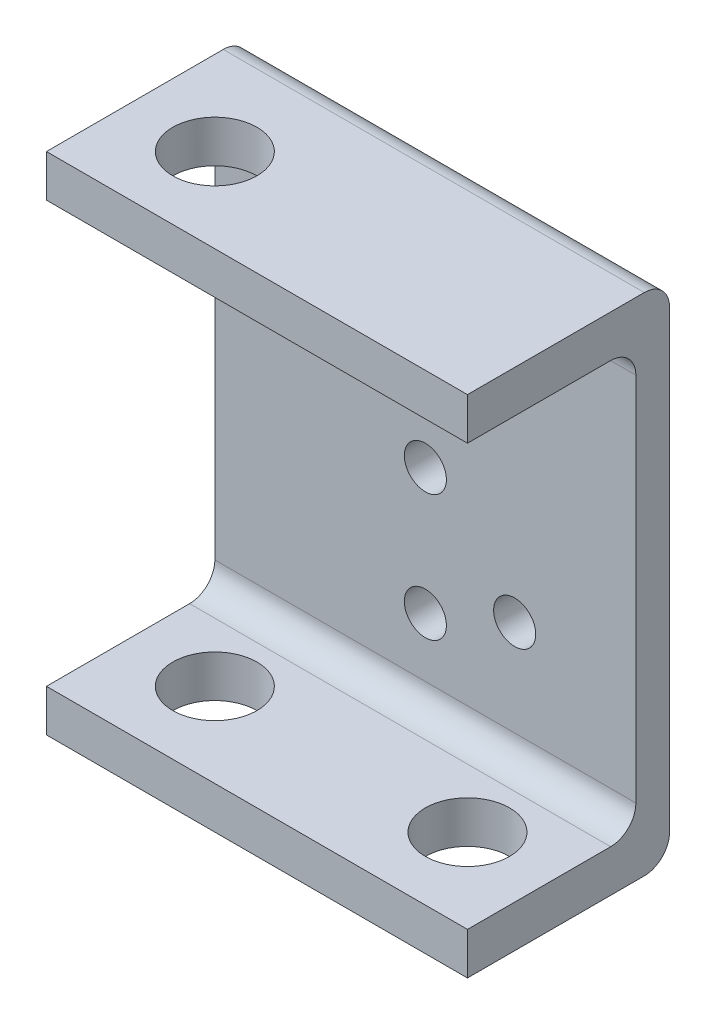
ISO-10303-21;
HEADER;
FILE_DESCRIPTION(('STEP AP214'),'2;1');
FILE_NAME('part.step','',(''),(''),'','','');
FILE_SCHEMA(('AUTOMOTIVE_DESIGN { 1 0 10303 214 1 1 1 1 }'));
ENDSEC;
DATA;
#1=APPLICATION_CONTEXT('core data for automotive mechanical design processes');
#2=APPLICATION_PROTOCOL_DEFINITION('international standard','automotive_design',2000,#1);
#3=PRODUCT_CONTEXT('',#1,'mechanical');
#4=PRODUCT('Part','Part','',(#3));
#5=PRODUCT_RELATED_PRODUCT_CATEGORY('part','',(#4));
#6=PRODUCT_DEFINITION_FORMATION('','',#4);
#7=PRODUCT_DEFINITION_CONTEXT('part definition',#1,'design');
#8=PRODUCT_DEFINITION('design','',#6,#7);
#9=PRODUCT_DEFINITION_SHAPE('','',#8);
#10=(LENGTH_UNIT() NAMED_UNIT(*) SI_UNIT(.MILLI.,.METRE.));
#11=(NAMED_UNIT(*) PLANE_ANGLE_UNIT() SI_UNIT($,.RADIAN.));
#12=(NAMED_UNIT(*) SI_UNIT($,.STERADIAN.) SOLID_ANGLE_UNIT());
#13=UNCERTAINTY_MEASURE_WITH_UNIT(LENGTH_MEASURE(1.E-05),#10,'distance_accuracy_value','');
#14=(GEOMETRIC_REPRESENTATION_CONTEXT(3) GLOBAL_UNCERTAINTY_ASSIGNED_CONTEXT((#13)) GLOBAL_UNIT_ASSIGNED_CONTEXT((#10,
#11,#12)) REPRESENTATION_CONTEXT('',''));
#15=CARTESIAN_POINT('',(0.,0.,0.));
#16=DIRECTION('',(0.,0.,1.));
#17=DIRECTION('',(1.,0.,0.));
#18=AXIS2_PLACEMENT_3D('',#15,#16,#17);
#19=CARTESIAN_POINT('',(25.,-22.,7.));
#20=DIRECTION('',(-1.,0.,0.));
#21=DIRECTION('',(0.,0.,1.));
#22=AXIS2_PLACEMENT_3D('',#19,#20,#21);
#23=CYLINDRICAL_SURFACE('',#22,3.);
#24=CARTESIAN_POINT('',(-25.,-22.,7.));
#25=DIRECTION('',(-1.,0.,0.));
#26=DIRECTION('',(0.,0.,1.));
#27=AXIS2_PLACEMENT_3D('',#24,#25,#26);
#28=CIRCLE('',#27,3.);
#29=CARTESIAN_POINT('',(-25.,-22.,4.));
#30=VERTEX_POINT('',#29);
#31=CARTESIAN_POINT('',(-25.,-25.,7.));
#32=VERTEX_POINT('',#31);
#33=EDGE_CURVE('E156',#30,#32,#28,.T.);
#34=ORIENTED_EDGE('',*,*,#33,.T.);
#35=DIRECTION('',(-1.,0.,0.));
#36=VECTOR('',#35,1.);
#37=CARTESIAN_POINT('',(25.,-25.,7.));
#38=LINE('',#37,#36);
#39=CARTESIAN_POINT('',(25.,-25.,7.));
#40=VERTEX_POINT('',#39);
#41=EDGE_CURVE('E11',#40,#32,#38,.T.);
#42=ORIENTED_EDGE('',*,*,#41,.F.);
#43=CARTESIAN_POINT('',(25.,-22.,7.));
#44=DIRECTION('',(-1.,0.,0.));
#45=DIRECTION('',(0.,0.,1.));
#46=AXIS2_PLACEMENT_3D('',#43,#44,#45);
#47=CIRCLE('',#46,3.);
#48=CARTESIAN_POINT('',(25.,-22.,4.));
#49=VERTEX_POINT('',#48);
#50=EDGE_CURVE('E179',#49,#40,#47,.T.);
#51=ORIENTED_EDGE('',*,*,#50,.F.);
#52=DIRECTION('',(-1.,0.,0.));
#53=VECTOR('',#52,1.);
#54=CARTESIAN_POINT('',(25.,-22.,4.));
#55=LINE('',#54,#53);
#56=EDGE_CURVE('E152',#49,#30,#55,.T.);
#57=ORIENTED_EDGE('',*,*,#56,.T.);
#58=EDGE_LOOP('',(#34,#42,#51,#57));
#59=FACE_BOUND('',#58,.T.);
#60=ADVANCED_FACE('F35',(#59),#23,.F.);
#61=CARTESIAN_POINT('',(25.,-25.,7.));
#62=DIRECTION('',(0.,-1.,0.));
#63=DIRECTION('',(0.,0.,-1.));
#64=AXIS2_PLACEMENT_3D('',#61,#62,#63);
#65=PLANE('',#64);
#66=CARTESIAN_POINT('',(15.,-25.,14.));
#67=DIRECTION('',(0.,-1.,0.));
#68=DIRECTION('',(0.,0.,-1.));
#69=AXIS2_PLACEMENT_3D('',#66,#67,#68);
#70=CIRCLE('',#69,5.);
#71=CARTESIAN_POINT('',(15.,-25.,9.00000000000001));
#72=VERTEX_POINT('',#71);
#73=EDGE_CURVE('E309',#72,#72,#70,.F.);
#74=ORIENTED_EDGE('',*,*,#73,.F.);
#75=EDGE_LOOP('',(#74));
#76=FACE_BOUND('',#75,.T.);
#77=CARTESIAN_POINT('',(-15.,-25.,14.));
#78=DIRECTION('',(0.,-1.,0.));
#79=DIRECTION('',(0.,0.,-1.));
#80=AXIS2_PLACEMENT_3D('',#77,#78,#79);
#81=CIRCLE('',#80,5.);
#82=CARTESIAN_POINT('',(-15.,-25.,9.00000000000001));
#83=VERTEX_POINT('',#82);
#84=EDGE_CURVE('E298',#83,#83,#81,.T.);
#85=ORIENTED_EDGE('',*,*,#84,.T.);
#86=EDGE_LOOP('',(#85));
#87=FACE_BOUND('',#86,.T.);
#88=DIRECTION('',(0.,0.,1.));
#89=VECTOR('',#88,1.);
#90=CARTESIAN_POINT('',(-25.,-25.,7.));
#91=LINE('',#90,#89);
#92=CARTESIAN_POINT('',(-25.,-25.,24.));
#93=VERTEX_POINT('',#92);
#94=EDGE_CURVE('E159',#32,#93,#91,.T.);
#95=ORIENTED_EDGE('',*,*,#94,.T.);
#96=DIRECTION('',(-1.,0.,0.));
#97=VECTOR('',#96,1.);
#98=CARTESIAN_POINT('',(25.,-25.,24.));
#99=LINE('',#98,#97);
#100=CARTESIAN_POINT('',(25.,-25.,24.));
#101=VERTEX_POINT('',#100);
#102=EDGE_CURVE('E44',#101,#93,#99,.T.);
#103=ORIENTED_EDGE('',*,*,#102,.F.);
#104=DIRECTION('',(0.,0.,1.));
#105=VECTOR('',#104,1.);
#106=CARTESIAN_POINT('',(25.,-25.,7.));
#107=LINE('',#106,#105);
#108=EDGE_CURVE('E107',#40,#101,#107,.T.);
#109=ORIENTED_EDGE('',*,*,#108,.F.);
#110=ORIENTED_EDGE('',*,*,#41,.T.);
#111=EDGE_LOOP('',(#95,#103,#109,#110));
#112=FACE_BOUND('',#111,.T.);
#113=ADVANCED_FACE('F261',(#76,#87,#112),#65,.F.);
#114=CARTESIAN_POINT('',(25.,-25.,24.));
#115=DIRECTION('',(0.,0.,-1.));
#116=DIRECTION('',(0.,1.,0.));
#117=AXIS2_PLACEMENT_3D('',#114,#115,#116);
#118=PLANE('',#117);
#119=DIRECTION('',(0.,-1.,0.));
#120=VECTOR('',#119,1.);
#121=CARTESIAN_POINT('',(-25.,-25.,24.));
#122=LINE('',#121,#120);
#123=CARTESIAN_POINT('',(-25.,-30.,24.));
#124=VERTEX_POINT('',#123);
#125=EDGE_CURVE('E162',#93,#124,#122,.T.);
#126=ORIENTED_EDGE('',*,*,#125,.T.);
#127=DIRECTION('',(-1.,0.,0.));
#128=VECTOR('',#127,1.);
#129=CARTESIAN_POINT('',(25.,-30.,24.));
#130=LINE('',#129,#128);
#131=CARTESIAN_POINT('',(25.,-30.,24.));
#132=VERTEX_POINT('',#131);
#133=EDGE_CURVE('E198',#132,#124,#130,.T.);
#134=ORIENTED_EDGE('',*,*,#133,.F.);
#135=DIRECTION('',(0.,-1.,0.));
#136=VECTOR('',#135,1.);
#137=CARTESIAN_POINT('',(25.,-25.,24.));
#138=LINE('',#137,#136);
#139=EDGE_CURVE('E207',#101,#132,#138,.T.);
#140=ORIENTED_EDGE('',*,*,#139,.F.);
#141=ORIENTED_EDGE('',*,*,#102,.T.);
#142=EDGE_LOOP('',(#126,#134,#140,#141));
#143=FACE_BOUND('',#142,.T.);
#144=ADVANCED_FACE('F205',(#143),#118,.F.);
#145=CARTESIAN_POINT('',(25.,-30.,24.));
#146=DIRECTION('',(0.,1.,0.));
#147=DIRECTION('',(0.,0.,1.));
#148=AXIS2_PLACEMENT_3D('',#145,#146,#147);
#149=PLANE('',#148);
#150=CARTESIAN_POINT('',(15.,-30.,14.));
#151=DIRECTION('',(0.,-1.,0.));
#152=DIRECTION('',(0.,0.,-1.));
#153=AXIS2_PLACEMENT_3D('',#150,#151,#152);
#154=CIRCLE('',#153,5.);
#155=CARTESIAN_POINT('',(15.,-30.,9.00000000000001));
#156=VERTEX_POINT('',#155);
#157=EDGE_CURVE('E386',#156,#156,#154,.T.);
#158=ORIENTED_EDGE('',*,*,#157,.F.);
#159=EDGE_LOOP('',(#158));
#160=FACE_BOUND('',#159,.T.);
#161=CARTESIAN_POINT('',(-15.,-30.,14.));
#162=DIRECTION('',(0.,-1.,0.));
#163=DIRECTION('',(0.,0.,-1.));
#164=AXIS2_PLACEMENT_3D('',#161,#162,#163);
#165=CIRCLE('',#164,5.);
#166=CARTESIAN_POINT('',(-15.,-30.,9.00000000000001));
#167=VERTEX_POINT('',#166);
#168=EDGE_CURVE('E304',#167,#167,#165,.T.);
#169=ORIENTED_EDGE('',*,*,#168,.F.);
#170=EDGE_LOOP('',(#169));
#171=FACE_BOUND('',#170,.T.);
#172=DIRECTION('',(0.,0.,-1.));
#173=VECTOR('',#172,1.);
#174=CARTESIAN_POINT('',(-25.,-30.,24.));
#175=LINE('',#174,#173);
#176=CARTESIAN_POINT('',(-25.,-30.,2.99999999999999));
#177=VERTEX_POINT('',#176);
#178=EDGE_CURVE('E164',#124,#177,#175,.T.);
#179=ORIENTED_EDGE('',*,*,#178,.T.);
#180=DIRECTION('',(-1.,0.,0.));
#181=VECTOR('',#180,1.);
#182=CARTESIAN_POINT('',(25.,-30.,2.99999999999999));
#183=LINE('',#182,#181);
#184=CARTESIAN_POINT('',(25.,-30.,2.99999999999999));
#185=VERTEX_POINT('',#184);
#186=EDGE_CURVE('E195',#185,#177,#183,.T.);
#187=ORIENTED_EDGE('',*,*,#186,.F.);
#188=DIRECTION('',(0.,0.,-1.));
#189=VECTOR('',#188,1.);
#190=CARTESIAN_POINT('',(25.,-30.,24.));
#191=LINE('',#190,#189);
#192=EDGE_CURVE('E225',#132,#185,#191,.T.);
#193=ORIENTED_EDGE('',*,*,#192,.F.);
#194=ORIENTED_EDGE('',*,*,#133,.T.);
#195=EDGE_LOOP('',(#179,#187,#193,#194));
#196=FACE_BOUND('',#195,.T.);
#197=ADVANCED_FACE('F216',(#160,#171,#196),#149,.F.);
#198=CARTESIAN_POINT('',(25.,-27.,2.99999999999999));
#199=DIRECTION('',(-1.,0.,0.));
#200=DIRECTION('',(0.,0.,1.));
#201=AXIS2_PLACEMENT_3D('',#198,#199,#200);
#202=CYLINDRICAL_SURFACE('',#201,3.);
#203=CARTESIAN_POINT('',(-25.,-27.,2.99999999999999));
#204=DIRECTION('',(1.,0.,0.));
#205=DIRECTION('',(0.,0.,1.));
#206=AXIS2_PLACEMENT_3D('',#203,#204,#205);
#207=CIRCLE('',#206,3.);
#208=CARTESIAN_POINT('',(-25.,-27.,0.));
#209=VERTEX_POINT('',#208);
#210=EDGE_CURVE('E166',#177,#209,#207,.T.);
#211=ORIENTED_EDGE('',*,*,#210,.T.);
#212=DIRECTION('',(-1.,0.,0.));
#213=VECTOR('',#212,1.);
#214=CARTESIAN_POINT('',(25.,-27.,0.));
#215=LINE('',#214,#213);
#216=CARTESIAN_POINT('',(25.,-27.,0.));
#217=VERTEX_POINT('',#216);
#218=EDGE_CURVE('E192',#217,#209,#215,.T.);
#219=ORIENTED_EDGE('',*,*,#218,.F.);
#220=CARTESIAN_POINT('',(25.,-27.,2.99999999999999));
#221=DIRECTION('',(1.,0.,0.));
#222=DIRECTION('',(0.,0.,1.));
#223=AXIS2_PLACEMENT_3D('',#220,#221,#222);
#224=CIRCLE('',#223,3.);
#225=EDGE_CURVE('E222',#185,#217,#224,.T.);
#226=ORIENTED_EDGE('',*,*,#225,.F.);
#227=ORIENTED_EDGE('',*,*,#186,.T.);
#228=EDGE_LOOP('',(#211,#219,#226,#227));
#229=FACE_BOUND('',#228,.T.);
#230=ADVANCED_FACE('F220',(#229),#202,.T.);
#231=CARTESIAN_POINT('',(25.,27.,0.));
#232=DIRECTION('',(0.,0.,1.));
#233=DIRECTION('',(1.,0.,0.));
#234=AXIS2_PLACEMENT_3D('',#231,#232,#233);
#235=PLANE('',#234);
#236=CARTESIAN_POINT('',(0.,15.,0.));
#237=DIRECTION('',(0.,0.,-1.));
#238=DIRECTION('',(-1.,0.,0.));
#239=AXIS2_PLACEMENT_3D('',#236,#237,#238);
#240=CIRCLE('',#239,2.5);
#241=CARTESIAN_POINT('',(-2.5,15.,0.));
#242=VERTEX_POINT('',#241);
#243=EDGE_CURVE('E316',#242,#242,#240,.T.);
#244=ORIENTED_EDGE('',*,*,#243,.F.);
#245=EDGE_LOOP('',(#244));
#246=FACE_BOUND('',#245,.T.);
#247=CARTESIAN_POINT('',(-10.6066017177982,10.6066017177982,0.));
#248=DIRECTION('',(0.,0.,-1.));
#249=DIRECTION('',(-1.,0.,0.));
#250=AXIS2_PLACEMENT_3D('',#247,#248,#249);
#251=CIRCLE('',#250,2.5);
#252=CARTESIAN_POINT('',(-13.1066017177982,10.6066017177982,0.));
#253=VERTEX_POINT('',#252);
#254=EDGE_CURVE('E322',#253,#253,#251,.T.);
#255=ORIENTED_EDGE('',*,*,#254,.F.);
#256=EDGE_LOOP('',(#255));
#257=FACE_BOUND('',#256,.T.);
#258=CARTESIAN_POINT('',(10.6066017177982,-10.6066017177983,0.));
#259=DIRECTION('',(0.,0.,-1.));
#260=DIRECTION('',(-1.,0.,0.));
#261=AXIS2_PLACEMENT_3D('',#258,#259,#260);
#262=CIRCLE('',#261,2.5);
#263=CARTESIAN_POINT('',(8.10660171779815,-10.6066017177983,0.));
#264=VERTEX_POINT('',#263);
#265=EDGE_CURVE('E328',#264,#264,#262,.T.);
#266=ORIENTED_EDGE('',*,*,#265,.F.);
#267=EDGE_LOOP('',(#266));
#268=FACE_BOUND('',#267,.T.);
#269=CARTESIAN_POINT('',(0.,-15.,0.));
#270=DIRECTION('',(0.,0.,-1.));
#271=DIRECTION('',(-1.,0.,0.));
#272=AXIS2_PLACEMENT_3D('',#269,#270,#271);
#273=CIRCLE('',#272,2.5);
#274=CARTESIAN_POINT('',(-2.5,-15.,0.));
#275=VERTEX_POINT('',#274);
#276=EDGE_CURVE('E301',#275,#275,#273,.T.);
#277=ORIENTED_EDGE('',*,*,#276,.F.);
#278=EDGE_LOOP('',(#277));
#279=FACE_BOUND('',#278,.T.);
#280=CARTESIAN_POINT('',(0.,0.,0.));
#281=DIRECTION('',(0.,0.,-1.));
#282=DIRECTION('',(-1.,0.,0.));
#283=AXIS2_PLACEMENT_3D('',#280,#281,#282);
#284=CIRCLE('',#283,2.5);
#285=CARTESIAN_POINT('',(-2.5,0.,0.));
#286=VERTEX_POINT('',#285);
#287=EDGE_CURVE('E315',#286,#286,#284,.T.);
#288=ORIENTED_EDGE('',*,*,#287,.F.);
#289=EDGE_LOOP('',(#288));
#290=FACE_BOUND('',#289,.T.);
#291=DIRECTION('',(0.,1.,0.));
#292=VECTOR('',#291,1.);
#293=CARTESIAN_POINT('',(-25.,27.,0.));
#294=LINE('',#293,#292);
#295=CARTESIAN_POINT('',(-25.,27.,0.));
#296=VERTEX_POINT('',#295);
#297=EDGE_CURVE('E168',#209,#296,#294,.T.);
#298=ORIENTED_EDGE('',*,*,#297,.T.);
#299=DIRECTION('',(-1.,0.,0.));
#300=VECTOR('',#299,1.);
#301=CARTESIAN_POINT('',(25.,27.,0.));
#302=LINE('',#301,#300);
#303=CARTESIAN_POINT('',(25.,27.,0.));
#304=VERTEX_POINT('',#303);
#305=EDGE_CURVE('E189',#304,#296,#302,.T.);
#306=ORIENTED_EDGE('',*,*,#305,.F.);
#307=DIRECTION('',(0.,1.,0.));
#308=VECTOR('',#307,1.);
#309=CARTESIAN_POINT('',(25.,27.,0.));
#310=LINE('',#309,#308);
#311=EDGE_CURVE('E224',#217,#304,#310,.T.);
#312=ORIENTED_EDGE('',*,*,#311,.F.);
#313=ORIENTED_EDGE('',*,*,#218,.T.);
#314=EDGE_LOOP('',(#298,#306,#312,#313));
#315=FACE_BOUND('',#314,.T.);
#316=ADVANCED_FACE('F278',(#246,#257,#268,#279,#290,#315),#235,.F.);
#317=CARTESIAN_POINT('',(25.,27.,2.99999999999999));
#318=DIRECTION('',(-1.,0.,0.));
#319=DIRECTION('',(0.,0.,1.));
#320=AXIS2_PLACEMENT_3D('',#317,#318,#319);
#321=CYLINDRICAL_SURFACE('',#320,3.);
#322=CARTESIAN_POINT('',(-25.,27.,2.99999999999999));
#323=DIRECTION('',(1.,0.,0.));
#324=DIRECTION('',(0.,0.,-1.));
#325=AXIS2_PLACEMENT_3D('',#322,#323,#324);
#326=CIRCLE('',#325,3.);
#327=CARTESIAN_POINT('',(-25.,30.,2.99999999999999));
#328=VERTEX_POINT('',#327);
#329=EDGE_CURVE('E170',#296,#328,#326,.T.);
#330=ORIENTED_EDGE('',*,*,#329,.T.);
#331=DIRECTION('',(-1.,0.,0.));
#332=VECTOR('',#331,1.);
#333=CARTESIAN_POINT('',(25.,30.,2.99999999999999));
#334=LINE('',#333,#332);
#335=CARTESIAN_POINT('',(25.,30.,2.99999999999999));
#336=VERTEX_POINT('',#335);
#337=EDGE_CURVE('E186',#336,#328,#334,.T.);
#338=ORIENTED_EDGE('',*,*,#337,.F.);
#339=CARTESIAN_POINT('',(25.,27.,2.99999999999999));
#340=DIRECTION('',(1.,0.,0.));
#341=DIRECTION('',(0.,0.,-1.));
#342=AXIS2_PLACEMENT_3D('',#339,#340,#341);
#343=CIRCLE('',#342,3.);
#344=EDGE_CURVE('E227',#304,#336,#343,.T.);
#345=ORIENTED_EDGE('',*,*,#344,.F.);
#346=ORIENTED_EDGE('',*,*,#305,.T.);
#347=EDGE_LOOP('',(#330,#338,#345,#346));
#348=FACE_BOUND('',#347,.T.);
#349=ADVANCED_FACE('F281',(#348),#321,.T.);
#350=CARTESIAN_POINT('',(25.,30.,2.99999999999999));
#351=DIRECTION('',(0.,-1.,0.));
#352=DIRECTION('',(0.,0.,-1.));
#353=AXIS2_PLACEMENT_3D('',#350,#351,#352);
#354=PLANE('',#353);
#355=CARTESIAN_POINT('',(-15.,30.,14.));
#356=DIRECTION('',(0.,-1.,0.));
#357=DIRECTION('',(0.,0.,-1.));
#358=AXIS2_PLACEMENT_3D('',#355,#356,#357);
#359=CIRCLE('',#358,5.);
#360=CARTESIAN_POINT('',(-15.,30.,9.00000000000001));
#361=VERTEX_POINT('',#360);
#362=EDGE_CURVE('E299',#361,#361,#359,.F.);
#363=ORIENTED_EDGE('',*,*,#362,.F.);
#364=EDGE_LOOP('',(#363));
#365=FACE_BOUND('',#364,.T.);
#366=DIRECTION('',(0.,0.,1.));
#367=VECTOR('',#366,1.);
#368=CARTESIAN_POINT('',(-25.,30.,2.99999999999999));
#369=LINE('',#368,#367);
#370=CARTESIAN_POINT('',(-25.,30.,24.));
#371=VERTEX_POINT('',#370);
#372=EDGE_CURVE('E172',#328,#371,#369,.T.);
#373=ORIENTED_EDGE('',*,*,#372,.T.);
#374=DIRECTION('',(-1.,0.,0.));
#375=VECTOR('',#374,1.);
#376=CARTESIAN_POINT('',(25.,30.,24.));
#377=LINE('',#376,#375);
#378=CARTESIAN_POINT('',(25.,30.,24.));
#379=VERTEX_POINT('',#378);
#380=EDGE_CURVE('E183',#379,#371,#377,.T.);
#381=ORIENTED_EDGE('',*,*,#380,.F.);
#382=DIRECTION('',(0.,0.,1.));
#383=VECTOR('',#382,1.);
#384=CARTESIAN_POINT('',(25.,30.,2.99999999999999));
#385=LINE('',#384,#383);
#386=EDGE_CURVE('E233',#336,#379,#385,.T.);
#387=ORIENTED_EDGE('',*,*,#386,.F.);
#388=ORIENTED_EDGE('',*,*,#337,.T.);
#389=EDGE_LOOP('',(#373,#381,#387,#388));
#390=FACE_BOUND('',#389,.T.);
#391=ADVANCED_FACE('F239',(#365,#390),#354,.F.);
#392=CARTESIAN_POINT('',(25.,30.,24.));
#393=DIRECTION('',(0.,0.,-1.));
#394=DIRECTION('',(0.,1.,0.));
#395=AXIS2_PLACEMENT_3D('',#392,#393,#394);
#396=PLANE('',#395);
#397=DIRECTION('',(0.,-1.,0.));
#398=VECTOR('',#397,1.);
#399=CARTESIAN_POINT('',(-25.,30.,24.));
#400=LINE('',#399,#398);
#401=CARTESIAN_POINT('',(-25.,25.,24.));
#402=VERTEX_POINT('',#401);
#403=EDGE_CURVE('E174',#371,#402,#400,.T.);
#404=ORIENTED_EDGE('',*,*,#403,.T.);
#405=DIRECTION('',(-1.,0.,0.));
#406=VECTOR('',#405,1.);
#407=CARTESIAN_POINT('',(25.,25.,24.));
#408=LINE('',#407,#406);
#409=CARTESIAN_POINT('',(25.,25.,24.));
#410=VERTEX_POINT('',#409);
#411=EDGE_CURVE('E147',#410,#402,#408,.T.);
#412=ORIENTED_EDGE('',*,*,#411,.F.);
#413=DIRECTION('',(0.,-1.,0.));
#414=VECTOR('',#413,1.);
#415=CARTESIAN_POINT('',(25.,30.,24.));
#416=LINE('',#415,#414);
#417=EDGE_CURVE('E138',#379,#410,#416,.T.);
#418=ORIENTED_EDGE('',*,*,#417,.F.);
#419=ORIENTED_EDGE('',*,*,#380,.T.);
#420=EDGE_LOOP('',(#404,#412,#418,#419));
#421=FACE_BOUND('',#420,.T.);
#422=ADVANCED_FACE('F243',(#421),#396,.F.);
#423=CARTESIAN_POINT('',(25.,25.,24.));
#424=DIRECTION('',(0.,1.,0.));
#425=DIRECTION('',(0.,0.,1.));
#426=AXIS2_PLACEMENT_3D('',#423,#424,#425);
#427=PLANE('',#426);
#428=CARTESIAN_POINT('',(-15.,25.,14.));
#429=DIRECTION('',(0.,1.,0.));
#430=DIRECTION('',(0.,0.,1.));
#431=AXIS2_PLACEMENT_3D('',#428,#429,#430);
#432=CIRCLE('',#431,5.);
#433=CARTESIAN_POINT('',(-15.,25.,19.));
#434=VERTEX_POINT('',#433);
#435=EDGE_CURVE('E38',#434,#434,#432,.T.);
#436=ORIENTED_EDGE('',*,*,#435,.T.);
#437=EDGE_LOOP('',(#436));
#438=FACE_BOUND('',#437,.T.);
#439=DIRECTION('',(0.,0.,-1.));
#440=VECTOR('',#439,1.);
#441=CARTESIAN_POINT('',(-25.,25.,24.));
#442=LINE('',#441,#440);
#443=CARTESIAN_POINT('',(-25.,25.,7.));
#444=VERTEX_POINT('',#443);
#445=EDGE_CURVE('E146',#402,#444,#442,.T.);
#446=ORIENTED_EDGE('',*,*,#445,.T.);
#447=DIRECTION('',(-1.,0.,0.));
#448=VECTOR('',#447,1.);
#449=CARTESIAN_POINT('',(25.,25.,7.));
#450=LINE('',#449,#448);
#451=CARTESIAN_POINT('',(25.,25.,7.));
#452=VERTEX_POINT('',#451);
#453=EDGE_CURVE('E143',#452,#444,#450,.T.);
#454=ORIENTED_EDGE('',*,*,#453,.F.);
#455=DIRECTION('',(0.,0.,-1.));
#456=VECTOR('',#455,1.);
#457=CARTESIAN_POINT('',(25.,25.,24.));
#458=LINE('',#457,#456);
#459=EDGE_CURVE('E132',#410,#452,#458,.T.);
#460=ORIENTED_EDGE('',*,*,#459,.F.);
#461=ORIENTED_EDGE('',*,*,#411,.T.);
#462=EDGE_LOOP('',(#446,#454,#460,#461));
#463=FACE_BOUND('',#462,.T.);
#464=ADVANCED_FACE('F144',(#438,#463),#427,.F.);
#465=CARTESIAN_POINT('',(25.,22.,7.));
#466=DIRECTION('',(-1.,0.,0.));
#467=DIRECTION('',(0.,0.,1.));
#468=AXIS2_PLACEMENT_3D('',#465,#466,#467);
#469=CYLINDRICAL_SURFACE('',#468,3.);
#470=CARTESIAN_POINT('',(-25.,22.,7.));
#471=DIRECTION('',(-1.,0.,0.));
#472=DIRECTION('',(0.,0.,1.));
#473=AXIS2_PLACEMENT_3D('',#470,#471,#472);
#474=CIRCLE('',#473,3.);
#475=CARTESIAN_POINT('',(-25.,22.,4.));
#476=VERTEX_POINT('',#475);
#477=EDGE_CURVE('E93',#444,#476,#474,.T.);
#478=ORIENTED_EDGE('',*,*,#477,.T.);
#479=DIRECTION('',(-1.,0.,0.));
#480=VECTOR('',#479,1.);
#481=CARTESIAN_POINT('',(25.,22.,4.));
#482=LINE('',#481,#480);
#483=CARTESIAN_POINT('',(25.,22.,4.));
#484=VERTEX_POINT('',#483);
#485=EDGE_CURVE('E148',#484,#476,#482,.T.);
#486=ORIENTED_EDGE('',*,*,#485,.F.);
#487=CARTESIAN_POINT('',(25.,22.,7.));
#488=DIRECTION('',(-1.,0.,0.));
#489=DIRECTION('',(0.,0.,1.));
#490=AXIS2_PLACEMENT_3D('',#487,#488,#489);
#491=CIRCLE('',#490,3.);
#492=EDGE_CURVE('E136',#452,#484,#491,.T.);
#493=ORIENTED_EDGE('',*,*,#492,.F.);
#494=ORIENTED_EDGE('',*,*,#453,.T.);
#495=EDGE_LOOP('',(#478,#486,#493,#494));
#496=FACE_BOUND('',#495,.T.);
#497=ADVANCED_FACE('F150',(#496),#469,.F.);
#498=CARTESIAN_POINT('',(25.,22.,4.));
#499=DIRECTION('',(0.,0.,-1.));
#500=DIRECTION('',(-1.,0.,0.));
#501=AXIS2_PLACEMENT_3D('',#498,#499,#500);
#502=PLANE('',#501);
#503=CARTESIAN_POINT('',(0.,15.,3.99999999999997));
#504=DIRECTION('',(0.,0.,-1.));
#505=DIRECTION('',(-1.,0.,0.));
#506=AXIS2_PLACEMENT_3D('',#503,#504,#505);
#507=CIRCLE('',#506,2.5);
#508=CARTESIAN_POINT('',(-2.5,15.,3.99999999999997));
#509=VERTEX_POINT('',#508);
#510=EDGE_CURVE('E313',#509,#509,#507,.T.);
#511=ORIENTED_EDGE('',*,*,#510,.T.);
#512=EDGE_LOOP('',(#511));
#513=FACE_BOUND('',#512,.T.);
#514=CARTESIAN_POINT('',(-10.6066017177982,10.6066017177982,3.99999999999997));
#515=DIRECTION('',(0.,0.,-1.));
#516=DIRECTION('',(-1.,0.,0.));
#517=AXIS2_PLACEMENT_3D('',#514,#515,#516);
#518=CIRCLE('',#517,2.5);
#519=CARTESIAN_POINT('',(-13.1066017177982,10.6066017177982,3.99999999999997));
#520=VERTEX_POINT('',#519);
#521=EDGE_CURVE('E319',#520,#520,#518,.T.);
#522=ORIENTED_EDGE('',*,*,#521,.T.);
#523=EDGE_LOOP('',(#522));
#524=FACE_BOUND('',#523,.T.);
#525=CARTESIAN_POINT('',(10.6066017177982,-10.6066017177983,3.99999999999997));
#526=DIRECTION('',(0.,0.,-1.));
#527=DIRECTION('',(-1.,0.,0.));
#528=AXIS2_PLACEMENT_3D('',#525,#526,#527);
#529=CIRCLE('',#528,2.5);
#530=CARTESIAN_POINT('',(8.10660171779815,-10.6066017177983,3.99999999999997));
#531=VERTEX_POINT('',#530);
#532=EDGE_CURVE('E325',#531,#531,#529,.T.);
#533=ORIENTED_EDGE('',*,*,#532,.T.);
#534=EDGE_LOOP('',(#533));
#535=FACE_BOUND('',#534,.T.);
#536=CARTESIAN_POINT('',(0.,-15.,3.99999999999997));
#537=DIRECTION('',(0.,0.,-1.));
#538=DIRECTION('',(-1.,0.,0.));
#539=AXIS2_PLACEMENT_3D('',#536,#537,#538);
#540=CIRCLE('',#539,2.5);
#541=CARTESIAN_POINT('',(-2.5,-15.,3.99999999999997));
#542=VERTEX_POINT('',#541);
#543=EDGE_CURVE('E331',#542,#542,#540,.T.);
#544=ORIENTED_EDGE('',*,*,#543,.T.);
#545=EDGE_LOOP('',(#544));
#546=FACE_BOUND('',#545,.T.);
#547=CARTESIAN_POINT('',(0.,0.,3.99999999999997));
#548=DIRECTION('',(0.,0.,-1.));
#549=DIRECTION('',(-1.,0.,0.));
#550=AXIS2_PLACEMENT_3D('',#547,#548,#549);
#551=CIRCLE('',#550,2.5);
#552=CARTESIAN_POINT('',(-2.5,0.,3.99999999999997));
#553=VERTEX_POINT('',#552);
#554=EDGE_CURVE('E160',#553,#553,#551,.T.);
#555=ORIENTED_EDGE('',*,*,#554,.T.);
#556=EDGE_LOOP('',(#555));
#557=FACE_BOUND('',#556,.T.);
#558=DIRECTION('',(0.,-1.,0.));
#559=VECTOR('',#558,1.);
#560=CARTESIAN_POINT('',(-25.,22.,4.));
#561=LINE('',#560,#559);
#562=EDGE_CURVE('E99',#476,#30,#561,.T.);
#563=ORIENTED_EDGE('',*,*,#562,.T.);
#564=ORIENTED_EDGE('',*,*,#56,.F.);
#565=DIRECTION('',(0.,-1.,0.));
#566=VECTOR('',#565,1.);
#567=CARTESIAN_POINT('',(25.,22.,4.));
#568=LINE('',#567,#566);
#569=EDGE_CURVE('E52',#484,#49,#568,.T.);
#570=ORIENTED_EDGE('',*,*,#569,.F.);
#571=ORIENTED_EDGE('',*,*,#485,.T.);
#572=EDGE_LOOP('',(#563,#564,#570,#571));
#573=FACE_BOUND('',#572,.T.);
#574=ADVANCED_FACE('F247',(#513,#524,#535,#546,#557,#573),#502,.F.);
#575=CARTESIAN_POINT('',(25.,-22.,7.));
#576=DIRECTION('',(-1.,0.,0.));
#577=DIRECTION('',(0.,0.,1.));
#578=AXIS2_PLACEMENT_3D('',#575,#576,#577);
#579=PLANE('',#578);
#580=ORIENTED_EDGE('',*,*,#50,.T.);
#581=ORIENTED_EDGE('',*,*,#108,.T.);
#582=ORIENTED_EDGE('',*,*,#139,.T.);
#583=ORIENTED_EDGE('',*,*,#192,.T.);
#584=ORIENTED_EDGE('',*,*,#225,.T.);
#585=ORIENTED_EDGE('',*,*,#311,.T.);
#586=ORIENTED_EDGE('',*,*,#344,.T.);
#587=ORIENTED_EDGE('',*,*,#386,.T.);
#588=ORIENTED_EDGE('',*,*,#417,.T.);
#589=ORIENTED_EDGE('',*,*,#459,.T.);
#590=ORIENTED_EDGE('',*,*,#492,.T.);
#591=ORIENTED_EDGE('',*,*,#569,.T.);
#592=EDGE_LOOP('',(#580,#581,#582,#583,#584,#585,#586,#587,#588,#589,#590,#591));
#593=FACE_BOUND('',#592,.T.);
#594=ADVANCED_FACE('F134',(#593),#579,.F.);
#595=CARTESIAN_POINT('',(-25.,-22.,7.));
#596=DIRECTION('',(-1.,0.,0.));
#597=DIRECTION('',(0.,0.,1.));
#598=AXIS2_PLACEMENT_3D('',#595,#596,#597);
#599=PLANE('',#598);
#600=ORIENTED_EDGE('',*,*,#33,.F.);
#601=ORIENTED_EDGE('',*,*,#562,.F.);
#602=ORIENTED_EDGE('',*,*,#477,.F.);
#603=ORIENTED_EDGE('',*,*,#445,.F.);
#604=ORIENTED_EDGE('',*,*,#403,.F.);
#605=ORIENTED_EDGE('',*,*,#372,.F.);
#606=ORIENTED_EDGE('',*,*,#329,.F.);
#607=ORIENTED_EDGE('',*,*,#297,.F.);
#608=ORIENTED_EDGE('',*,*,#210,.F.);
#609=ORIENTED_EDGE('',*,*,#178,.F.);
#610=ORIENTED_EDGE('',*,*,#125,.F.);
#611=ORIENTED_EDGE('',*,*,#94,.F.);
#612=EDGE_LOOP('',(#600,#601,#602,#603,#604,#605,#606,#607,#608,#609,#610,#611));
#613=FACE_BOUND('',#612,.T.);
#614=ADVANCED_FACE('F211',(#613),#599,.T.);
#615=CARTESIAN_POINT('',(0.,0.,3.99999999999997));
#616=DIRECTION('',(0.,0.,-1.));
#617=DIRECTION('',(-1.,0.,0.));
#618=AXIS2_PLACEMENT_3D('',#615,#616,#617);
#619=CYLINDRICAL_SURFACE('',#618,2.5);
#620=ORIENTED_EDGE('',*,*,#554,.F.);
#621=EDGE_LOOP('',(#620));
#622=FACE_BOUND('',#621,.T.);
#623=ORIENTED_EDGE('',*,*,#287,.T.);
#624=EDGE_LOOP('',(#623));
#625=FACE_BOUND('',#624,.T.);
#626=ADVANCED_FACE('F343',(#622,#625),#619,.F.);
#627=CARTESIAN_POINT('',(0.,-15.,3.99999999999997));
#628=DIRECTION('',(0.,0.,-1.));
#629=DIRECTION('',(-1.,0.,0.));
#630=AXIS2_PLACEMENT_3D('',#627,#628,#629);
#631=CYLINDRICAL_SURFACE('',#630,2.5);
#632=ORIENTED_EDGE('',*,*,#543,.F.);
#633=EDGE_LOOP('',(#632));
#634=FACE_BOUND('',#633,.T.);
#635=ORIENTED_EDGE('',*,*,#276,.T.);
#636=EDGE_LOOP('',(#635));
#637=FACE_BOUND('',#636,.T.);
#638=ADVANCED_FACE('F349',(#634,#637),#631,.F.);
#639=CARTESIAN_POINT('',(10.6066017177982,-10.6066017177983,3.99999999999997));
#640=DIRECTION('',(0.,0.,-1.));
#641=DIRECTION('',(-1.,0.,0.));
#642=AXIS2_PLACEMENT_3D('',#639,#640,#641);
#643=CYLINDRICAL_SURFACE('',#642,2.5);
#644=ORIENTED_EDGE('',*,*,#532,.F.);
#645=EDGE_LOOP('',(#644));
#646=FACE_BOUND('',#645,.T.);
#647=ORIENTED_EDGE('',*,*,#265,.T.);
#648=EDGE_LOOP('',(#647));
#649=FACE_BOUND('',#648,.T.);
#650=ADVANCED_FACE('F356',(#646,#649),#643,.F.);
#651=CARTESIAN_POINT('',(-10.6066017177982,10.6066017177982,3.99999999999997));
#652=DIRECTION('',(0.,0.,-1.));
#653=DIRECTION('',(-1.,0.,0.));
#654=AXIS2_PLACEMENT_3D('',#651,#652,#653);
#655=CYLINDRICAL_SURFACE('',#654,2.5);
#656=ORIENTED_EDGE('',*,*,#521,.F.);
#657=EDGE_LOOP('',(#656));
#658=FACE_BOUND('',#657,.T.);
#659=ORIENTED_EDGE('',*,*,#254,.T.);
#660=EDGE_LOOP('',(#659));
#661=FACE_BOUND('',#660,.T.);
#662=ADVANCED_FACE('F363',(#658,#661),#655,.F.);
#663=CARTESIAN_POINT('',(0.,15.,3.99999999999997));
#664=DIRECTION('',(0.,0.,-1.));
#665=DIRECTION('',(-1.,0.,0.));
#666=AXIS2_PLACEMENT_3D('',#663,#664,#665);
#667=CYLINDRICAL_SURFACE('',#666,2.5);
#668=ORIENTED_EDGE('',*,*,#510,.F.);
#669=EDGE_LOOP('',(#668));
#670=FACE_BOUND('',#669,.T.);
#671=ORIENTED_EDGE('',*,*,#243,.T.);
#672=EDGE_LOOP('',(#671));
#673=FACE_BOUND('',#672,.T.);
#674=ADVANCED_FACE('F367',(#670,#673),#667,.F.);
#675=CARTESIAN_POINT('',(-15.,44.142135623731,14.));
#676=DIRECTION('',(0.,-1.,0.));
#677=DIRECTION('',(0.,0.,-1.));
#678=AXIS2_PLACEMENT_3D('',#675,#676,#677);
#679=CYLINDRICAL_SURFACE('',#678,5.);
#680=ORIENTED_EDGE('',*,*,#362,.T.);
#681=EDGE_LOOP('',(#680));
#682=FACE_BOUND('',#681,.T.);
#683=ORIENTED_EDGE('',*,*,#435,.F.);
#684=EDGE_LOOP('',(#683));
#685=FACE_BOUND('',#684,.T.);
#686=ADVANCED_FACE('F371',(#682,#685),#679,.F.);
#687=ORIENTED_EDGE('',*,*,#168,.T.);
#688=EDGE_LOOP('',(#687));
#689=FACE_BOUND('',#688,.T.);
#690=ORIENTED_EDGE('',*,*,#84,.F.);
#691=EDGE_LOOP('',(#690));
#692=FACE_BOUND('',#691,.T.);
#693=ADVANCED_FACE('F373',(#689,#692),#679,.F.);
#694=CARTESIAN_POINT('',(15.,-10.857864376269,14.));
#695=DIRECTION('',(0.,-1.,0.));
#696=DIRECTION('',(0.,0.,-1.));
#697=AXIS2_PLACEMENT_3D('',#694,#695,#696);
#698=CYLINDRICAL_SURFACE('',#697,5.);
#699=ORIENTED_EDGE('',*,*,#73,.T.);
#700=EDGE_LOOP('',(#699));
#701=FACE_BOUND('',#700,.T.);
#702=ORIENTED_EDGE('',*,*,#157,.T.);
#703=EDGE_LOOP('',(#702));
#704=FACE_BOUND('',#703,.T.);
#705=ADVANCED_FACE('F376',(#701,#704),#698,.F.);
#706=CLOSED_SHELL('',(#60,#113,#144,#197,#230,#316,#349,#391,#422,#464,#497,#574,#594,#614,#626,
#638,#650,#662,#674,#686,#693,#705));
#707=MANIFOLD_SOLID_BREP('B2',#706);
#708=ADVANCED_BREP_SHAPE_REPRESENTATION('',(#18,#707),#14);
#709=SHAPE_DEFINITION_REPRESENTATION(#9,#708);
ENDSEC;
END-ISO-10303-21;
